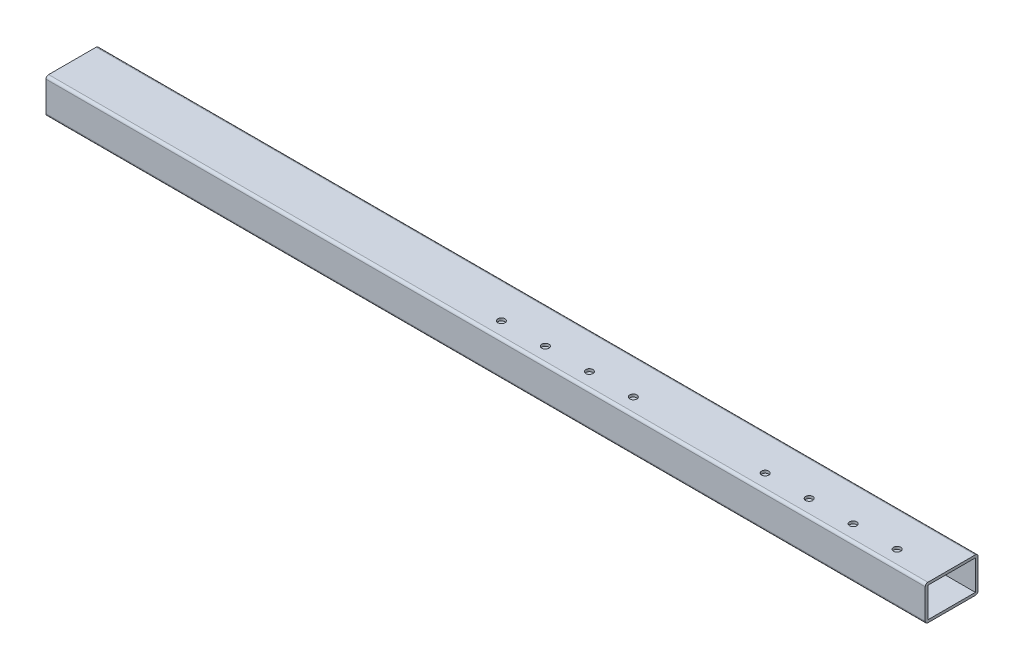
ISO-10303-21;
HEADER;
FILE_DESCRIPTION(('STEP AP214'),'2;1');
FILE_NAME('part.step','',(''),(''),'','','');
FILE_SCHEMA(('AUTOMOTIVE_DESIGN { 1 0 10303 214 1 1 1 1 }'));
ENDSEC;
DATA;
#1=APPLICATION_CONTEXT('core data for automotive mechanical design processes');
#2=APPLICATION_PROTOCOL_DEFINITION('international standard','automotive_design',2000,#1);
#3=PRODUCT_CONTEXT('',#1,'mechanical');
#4=PRODUCT('Part','Part','',(#3));
#5=PRODUCT_RELATED_PRODUCT_CATEGORY('part','',(#4));
#6=PRODUCT_DEFINITION_FORMATION('','',#4);
#7=PRODUCT_DEFINITION_CONTEXT('part definition',#1,'design');
#8=PRODUCT_DEFINITION('design','',#6,#7);
#9=PRODUCT_DEFINITION_SHAPE('','',#8);
#10=(LENGTH_UNIT() NAMED_UNIT(*) SI_UNIT(.MILLI.,.METRE.));
#11=(NAMED_UNIT(*) PLANE_ANGLE_UNIT() SI_UNIT($,.RADIAN.));
#12=(NAMED_UNIT(*) SI_UNIT($,.STERADIAN.) SOLID_ANGLE_UNIT());
#13=UNCERTAINTY_MEASURE_WITH_UNIT(LENGTH_MEASURE(1.E-05),#10,'distance_accuracy_value','');
#14=(GEOMETRIC_REPRESENTATION_CONTEXT(3) GLOBAL_UNCERTAINTY_ASSIGNED_CONTEXT((#13)) GLOBAL_UNIT_ASSIGNED_CONTEXT((#10,
#11,#12)) REPRESENTATION_CONTEXT('',''));
#15=CARTESIAN_POINT('',(0.,0.,0.));
#16=DIRECTION('',(0.,0.,1.));
#17=DIRECTION('',(1.,0.,0.));
#18=AXIS2_PLACEMENT_3D('',#15,#16,#17);
#19=CARTESIAN_POINT('',(1000.,17.,27.));
#20=DIRECTION('',(1.,0.,0.));
#21=DIRECTION('',(0.,0.,-1.));
#22=AXIS2_PLACEMENT_3D('',#19,#20,#21);
#23=PLANE('',#22);
#24=CARTESIAN_POINT('',(1000.,17.,27.));
#25=DIRECTION('',(1.,0.,0.));
#26=DIRECTION('',(0.,0.,-1.));
#27=AXIS2_PLACEMENT_3D('',#24,#25,#26);
#28=CIRCLE('',#27,2.99999999999999);
#29=CARTESIAN_POINT('',(1000.,20.,27.));
#30=VERTEX_POINT('',#29);
#31=CARTESIAN_POINT('',(1000.,17.,30.));
#32=VERTEX_POINT('',#31);
#33=EDGE_CURVE('E200',#30,#32,#28,.T.);
#34=ORIENTED_EDGE('',*,*,#33,.T.);
#35=DIRECTION('',(0.,-1.,0.));
#36=VECTOR('',#35,1.);
#37=CARTESIAN_POINT('',(1000.,17.,30.));
#38=LINE('',#37,#36);
#39=CARTESIAN_POINT('',(1000.,-17.,30.));
#40=VERTEX_POINT('',#39);
#41=EDGE_CURVE('E203',#32,#40,#38,.T.);
#42=ORIENTED_EDGE('',*,*,#41,.T.);
#43=CARTESIAN_POINT('',(1000.,-17.,27.));
#44=DIRECTION('',(1.,0.,0.));
#45=DIRECTION('',(0.,0.,-1.));
#46=AXIS2_PLACEMENT_3D('',#43,#44,#45);
#47=CIRCLE('',#46,3.);
#48=CARTESIAN_POINT('',(1000.,-20.,27.));
#49=VERTEX_POINT('',#48);
#50=EDGE_CURVE('E206',#40,#49,#47,.T.);
#51=ORIENTED_EDGE('',*,*,#50,.T.);
#52=DIRECTION('',(0.,0.,-1.));
#53=VECTOR('',#52,1.);
#54=CARTESIAN_POINT('',(1000.,-20.,27.));
#55=LINE('',#54,#53);
#56=CARTESIAN_POINT('',(1000.,-20.,-27.));
#57=VERTEX_POINT('',#56);
#58=EDGE_CURVE('E208',#49,#57,#55,.T.);
#59=ORIENTED_EDGE('',*,*,#58,.T.);
#60=CARTESIAN_POINT('',(1000.,-17.,-27.));
#61=DIRECTION('',(1.,0.,0.));
#62=DIRECTION('',(0.,0.,-1.));
#63=AXIS2_PLACEMENT_3D('',#60,#61,#62);
#64=CIRCLE('',#63,3.);
#65=CARTESIAN_POINT('',(1000.,-17.,-30.));
#66=VERTEX_POINT('',#65);
#67=EDGE_CURVE('E210',#57,#66,#64,.T.);
#68=ORIENTED_EDGE('',*,*,#67,.T.);
#69=DIRECTION('',(0.,1.,0.));
#70=VECTOR('',#69,1.);
#71=CARTESIAN_POINT('',(1000.,17.,-30.));
#72=LINE('',#71,#70);
#73=CARTESIAN_POINT('',(1000.,17.,-30.));
#74=VERTEX_POINT('',#73);
#75=EDGE_CURVE('E212',#66,#74,#72,.T.);
#76=ORIENTED_EDGE('',*,*,#75,.T.);
#77=CARTESIAN_POINT('',(1000.,17.,-27.));
#78=DIRECTION('',(1.,0.,0.));
#79=DIRECTION('',(0.,0.,1.));
#80=AXIS2_PLACEMENT_3D('',#77,#78,#79);
#81=CIRCLE('',#80,3.);
#82=CARTESIAN_POINT('',(1000.,20.,-27.));
#83=VERTEX_POINT('',#82);
#84=EDGE_CURVE('E214',#74,#83,#81,.T.);
#85=ORIENTED_EDGE('',*,*,#84,.T.);
#86=DIRECTION('',(0.,0.,1.));
#87=VECTOR('',#86,1.);
#88=CARTESIAN_POINT('',(1000.,20.,27.));
#89=LINE('',#88,#87);
#90=EDGE_CURVE('E216',#83,#30,#89,.T.);
#91=ORIENTED_EDGE('',*,*,#90,.T.);
#92=EDGE_LOOP('',(#34,#42,#51,#59,#68,#76,#85,#91));
#93=FACE_BOUND('',#92,.T.);
#94=DIRECTION('',(0.,0.,-1.));
#95=VECTOR('',#94,1.);
#96=CARTESIAN_POINT('',(1000.,-17.,27.));
#97=LINE('',#96,#95);
#98=CARTESIAN_POINT('',(1000.,-17.,27.));
#99=VERTEX_POINT('',#98);
#100=CARTESIAN_POINT('',(1000.,-17.,-27.));
#101=VERTEX_POINT('',#100);
#102=EDGE_CURVE('E170',#99,#101,#97,.T.);
#103=ORIENTED_EDGE('',*,*,#102,.F.);
#104=DIRECTION('',(0.,-1.,0.));
#105=VECTOR('',#104,1.);
#106=CARTESIAN_POINT('',(1000.,17.,27.));
#107=LINE('',#106,#105);
#108=CARTESIAN_POINT('',(1000.,17.,27.));
#109=VERTEX_POINT('',#108);
#110=EDGE_CURVE('E162',#109,#99,#107,.T.);
#111=ORIENTED_EDGE('',*,*,#110,.F.);
#112=DIRECTION('',(0.,0.,1.));
#113=VECTOR('',#112,1.);
#114=CARTESIAN_POINT('',(1000.,17.,27.));
#115=LINE('',#114,#113);
#116=CARTESIAN_POINT('',(1000.,17.,-27.));
#117=VERTEX_POINT('',#116);
#118=EDGE_CURVE('E184',#117,#109,#115,.T.);
#119=ORIENTED_EDGE('',*,*,#118,.F.);
#120=DIRECTION('',(0.,1.,0.));
#121=VECTOR('',#120,1.);
#122=CARTESIAN_POINT('',(1000.,17.,-27.));
#123=LINE('',#122,#121);
#124=EDGE_CURVE('E182',#101,#117,#123,.T.);
#125=ORIENTED_EDGE('',*,*,#124,.F.);
#126=EDGE_LOOP('',(#103,#111,#119,#125));
#127=FACE_BOUND('',#126,.T.);
#128=ADVANCED_FACE('F71',(#93,#127),#23,.T.);
#129=CARTESIAN_POINT('',(0.,17.,27.));
#130=DIRECTION('',(1.,0.,0.));
#131=DIRECTION('',(0.,0.,-1.));
#132=AXIS2_PLACEMENT_3D('',#129,#130,#131);
#133=PLANE('',#132);
#134=CARTESIAN_POINT('',(0.,17.,27.));
#135=DIRECTION('',(1.,0.,0.));
#136=DIRECTION('',(0.,0.,-1.));
#137=AXIS2_PLACEMENT_3D('',#134,#135,#136);
#138=CIRCLE('',#137,2.99999999999999);
#139=CARTESIAN_POINT('',(0.,20.,27.));
#140=VERTEX_POINT('',#139);
#141=CARTESIAN_POINT('',(0.,17.,30.));
#142=VERTEX_POINT('',#141);
#143=EDGE_CURVE('E178',#140,#142,#138,.T.);
#144=ORIENTED_EDGE('',*,*,#143,.F.);
#145=DIRECTION('',(0.,0.,1.));
#146=VECTOR('',#145,1.);
#147=CARTESIAN_POINT('',(0.,20.,27.));
#148=LINE('',#147,#146);
#149=CARTESIAN_POINT('',(0.,20.,-27.));
#150=VERTEX_POINT('',#149);
#151=EDGE_CURVE('E204',#150,#140,#148,.T.);
#152=ORIENTED_EDGE('',*,*,#151,.F.);
#153=CARTESIAN_POINT('',(0.,17.,-27.));
#154=DIRECTION('',(1.,0.,0.));
#155=DIRECTION('',(0.,0.,1.));
#156=AXIS2_PLACEMENT_3D('',#153,#154,#155);
#157=CIRCLE('',#156,3.);
#158=CARTESIAN_POINT('',(0.,17.,-30.));
#159=VERTEX_POINT('',#158);
#160=EDGE_CURVE('E231',#159,#150,#157,.T.);
#161=ORIENTED_EDGE('',*,*,#160,.F.);
#162=DIRECTION('',(0.,1.,0.));
#163=VECTOR('',#162,1.);
#164=CARTESIAN_POINT('',(0.,17.,-30.));
#165=LINE('',#164,#163);
#166=CARTESIAN_POINT('',(0.,-17.,-30.));
#167=VERTEX_POINT('',#166);
#168=EDGE_CURVE('E229',#167,#159,#165,.T.);
#169=ORIENTED_EDGE('',*,*,#168,.F.);
#170=CARTESIAN_POINT('',(0.,-17.,-27.));
#171=DIRECTION('',(1.,0.,0.));
#172=DIRECTION('',(0.,0.,-1.));
#173=AXIS2_PLACEMENT_3D('',#170,#171,#172);
#174=CIRCLE('',#173,3.);
#175=CARTESIAN_POINT('',(0.,-20.,-27.));
#176=VERTEX_POINT('',#175);
#177=EDGE_CURVE('E227',#176,#167,#174,.T.);
#178=ORIENTED_EDGE('',*,*,#177,.F.);
#179=DIRECTION('',(0.,0.,-1.));
#180=VECTOR('',#179,1.);
#181=CARTESIAN_POINT('',(0.,-20.,27.));
#182=LINE('',#181,#180);
#183=CARTESIAN_POINT('',(0.,-20.,27.));
#184=VERTEX_POINT('',#183);
#185=EDGE_CURVE('E225',#184,#176,#182,.T.);
#186=ORIENTED_EDGE('',*,*,#185,.F.);
#187=CARTESIAN_POINT('',(0.,-17.,27.));
#188=DIRECTION('',(1.,0.,0.));
#189=DIRECTION('',(0.,0.,-1.));
#190=AXIS2_PLACEMENT_3D('',#187,#188,#189);
#191=CIRCLE('',#190,3.);
#192=CARTESIAN_POINT('',(0.,-17.,30.));
#193=VERTEX_POINT('',#192);
#194=EDGE_CURVE('E223',#193,#184,#191,.T.);
#195=ORIENTED_EDGE('',*,*,#194,.F.);
#196=DIRECTION('',(0.,-1.,0.));
#197=VECTOR('',#196,1.);
#198=CARTESIAN_POINT('',(0.,17.,30.));
#199=LINE('',#198,#197);
#200=EDGE_CURVE('E221',#142,#193,#199,.T.);
#201=ORIENTED_EDGE('',*,*,#200,.F.);
#202=EDGE_LOOP('',(#144,#152,#161,#169,#178,#186,#195,#201));
#203=FACE_BOUND('',#202,.T.);
#204=DIRECTION('',(0.,-1.,0.));
#205=VECTOR('',#204,1.);
#206=CARTESIAN_POINT('',(0.,17.,27.));
#207=LINE('',#206,#205);
#208=CARTESIAN_POINT('',(0.,17.,27.));
#209=VERTEX_POINT('',#208);
#210=CARTESIAN_POINT('',(0.,-17.,27.));
#211=VERTEX_POINT('',#210);
#212=EDGE_CURVE('E96',#209,#211,#207,.T.);
#213=ORIENTED_EDGE('',*,*,#212,.T.);
#214=DIRECTION('',(0.,0.,-1.));
#215=VECTOR('',#214,1.);
#216=CARTESIAN_POINT('',(0.,-17.,27.));
#217=LINE('',#216,#215);
#218=CARTESIAN_POINT('',(0.,-17.,-27.));
#219=VERTEX_POINT('',#218);
#220=EDGE_CURVE('E177',#211,#219,#217,.T.);
#221=ORIENTED_EDGE('',*,*,#220,.T.);
#222=DIRECTION('',(0.,1.,0.));
#223=VECTOR('',#222,1.);
#224=CARTESIAN_POINT('',(0.,17.,-27.));
#225=LINE('',#224,#223);
#226=CARTESIAN_POINT('',(0.,17.,-27.));
#227=VERTEX_POINT('',#226);
#228=EDGE_CURVE('E192',#219,#227,#225,.T.);
#229=ORIENTED_EDGE('',*,*,#228,.T.);
#230=DIRECTION('',(0.,0.,1.));
#231=VECTOR('',#230,1.);
#232=CARTESIAN_POINT('',(0.,17.,27.));
#233=LINE('',#232,#231);
#234=EDGE_CURVE('E171',#227,#209,#233,.T.);
#235=ORIENTED_EDGE('',*,*,#234,.T.);
#236=EDGE_LOOP('',(#213,#221,#229,#235));
#237=FACE_BOUND('',#236,.T.);
#238=ADVANCED_FACE('F322',(#203,#237),#133,.F.);
#239=CARTESIAN_POINT('',(1000.,17.,27.));
#240=DIRECTION('',(-1.,0.,0.));
#241=DIRECTION('',(0.,0.,1.));
#242=AXIS2_PLACEMENT_3D('',#239,#240,#241);
#243=CYLINDRICAL_SURFACE('',#242,2.99999999999999);
#244=ORIENTED_EDGE('',*,*,#143,.T.);
#245=DIRECTION('',(-1.,0.,0.));
#246=VECTOR('',#245,1.);
#247=CARTESIAN_POINT('',(1000.,17.,30.));
#248=LINE('',#247,#246);
#249=EDGE_CURVE('E12',#32,#142,#248,.T.);
#250=ORIENTED_EDGE('',*,*,#249,.F.);
#251=ORIENTED_EDGE('',*,*,#33,.F.);
#252=DIRECTION('',(-1.,0.,0.));
#253=VECTOR('',#252,1.);
#254=CARTESIAN_POINT('',(1000.,20.,27.));
#255=LINE('',#254,#253);
#256=EDGE_CURVE('E218',#30,#140,#255,.T.);
#257=ORIENTED_EDGE('',*,*,#256,.T.);
#258=EDGE_LOOP('',(#244,#250,#251,#257));
#259=FACE_BOUND('',#258,.T.);
#260=ADVANCED_FACE('F73',(#259),#243,.T.);
#261=CARTESIAN_POINT('',(1000.,17.,30.));
#262=DIRECTION('',(0.,0.,-1.));
#263=DIRECTION('',(0.,1.,0.));
#264=AXIS2_PLACEMENT_3D('',#261,#262,#263);
#265=PLANE('',#264);
#266=ORIENTED_EDGE('',*,*,#200,.T.);
#267=DIRECTION('',(-1.,0.,0.));
#268=VECTOR('',#267,1.);
#269=CARTESIAN_POINT('',(1000.,-17.,30.));
#270=LINE('',#269,#268);
#271=EDGE_CURVE('E80',#40,#193,#270,.T.);
#272=ORIENTED_EDGE('',*,*,#271,.F.);
#273=ORIENTED_EDGE('',*,*,#41,.F.);
#274=ORIENTED_EDGE('',*,*,#249,.T.);
#275=EDGE_LOOP('',(#266,#272,#273,#274));
#276=FACE_BOUND('',#275,.T.);
#277=ADVANCED_FACE('F351',(#276),#265,.F.);
#278=CARTESIAN_POINT('',(1000.,-17.,27.));
#279=DIRECTION('',(-1.,0.,0.));
#280=DIRECTION('',(0.,0.,1.));
#281=AXIS2_PLACEMENT_3D('',#278,#279,#280);
#282=CYLINDRICAL_SURFACE('',#281,3.);
#283=ORIENTED_EDGE('',*,*,#194,.T.);
#284=DIRECTION('',(-1.,0.,0.));
#285=VECTOR('',#284,1.);
#286=CARTESIAN_POINT('',(1000.,-20.,27.));
#287=LINE('',#286,#285);
#288=EDGE_CURVE('E248',#49,#184,#287,.T.);
#289=ORIENTED_EDGE('',*,*,#288,.F.);
#290=ORIENTED_EDGE('',*,*,#50,.F.);
#291=ORIENTED_EDGE('',*,*,#271,.T.);
#292=EDGE_LOOP('',(#283,#289,#290,#291));
#293=FACE_BOUND('',#292,.T.);
#294=ADVANCED_FACE('F348',(#293),#282,.T.);
#295=CARTESIAN_POINT('',(1000.,-20.,27.));
#296=DIRECTION('',(0.,1.,0.));
#297=DIRECTION('',(0.,0.,1.));
#298=AXIS2_PLACEMENT_3D('',#295,#296,#297);
#299=PLANE('',#298);
#300=CARTESIAN_POINT('',(900.,-20.,12.0000000000003));
#301=DIRECTION('',(0.,1.,0.));
#302=DIRECTION('',(0.,0.,1.));
#303=AXIS2_PLACEMENT_3D('',#300,#301,#302);
#304=CIRCLE('',#303,4.05000000000013);
#305=CARTESIAN_POINT('',(900.,-20.,16.0500000000005));
#306=VERTEX_POINT('',#305);
#307=EDGE_CURVE('E261',#306,#306,#304,.T.);
#308=ORIENTED_EDGE('',*,*,#307,.T.);
#309=EDGE_LOOP('',(#308));
#310=FACE_BOUND('',#309,.T.);
#311=CARTESIAN_POINT('',(850.,-20.,12.0000000000007));
#312=DIRECTION('',(0.,1.,0.));
#313=DIRECTION('',(0.,0.,1.));
#314=AXIS2_PLACEMENT_3D('',#311,#312,#313);
#315=CIRCLE('',#314,4.05000000000013);
#316=CARTESIAN_POINT('',(850.,-20.,16.0500000000008));
#317=VERTEX_POINT('',#316);
#318=EDGE_CURVE('E448',#317,#317,#315,.T.);
#319=ORIENTED_EDGE('',*,*,#318,.T.);
#320=EDGE_LOOP('',(#319));
#321=FACE_BOUND('',#320,.T.);
#322=CARTESIAN_POINT('',(800.,-20.,12.000000000001));
#323=DIRECTION('',(0.,1.,0.));
#324=DIRECTION('',(0.,0.,1.));
#325=AXIS2_PLACEMENT_3D('',#322,#323,#324);
#326=CIRCLE('',#325,4.05000000000013);
#327=CARTESIAN_POINT('',(800.,-20.,16.0500000000012));
#328=VERTEX_POINT('',#327);
#329=EDGE_CURVE('E456',#328,#328,#326,.T.);
#330=ORIENTED_EDGE('',*,*,#329,.T.);
#331=EDGE_LOOP('',(#330));
#332=FACE_BOUND('',#331,.T.);
#333=CARTESIAN_POINT('',(650.,-20.,12.0000000000021));
#334=DIRECTION('',(0.,1.,0.));
#335=DIRECTION('',(0.,0.,1.));
#336=AXIS2_PLACEMENT_3D('',#333,#334,#335);
#337=CIRCLE('',#336,4.05000000000013);
#338=CARTESIAN_POINT('',(650.,-20.,16.0500000000022));
#339=VERTEX_POINT('',#338);
#340=EDGE_CURVE('E462',#339,#339,#337,.T.);
#341=ORIENTED_EDGE('',*,*,#340,.T.);
#342=EDGE_LOOP('',(#341));
#343=FACE_BOUND('',#342,.T.);
#344=CARTESIAN_POINT('',(600.,-20.,12.0000000000024));
#345=DIRECTION('',(0.,1.,0.));
#346=DIRECTION('',(0.,0.,1.));
#347=AXIS2_PLACEMENT_3D('',#344,#345,#346);
#348=CIRCLE('',#347,4.05000000000013);
#349=CARTESIAN_POINT('',(600.,-20.,16.0500000000026));
#350=VERTEX_POINT('',#349);
#351=EDGE_CURVE('E468',#350,#350,#348,.T.);
#352=ORIENTED_EDGE('',*,*,#351,.T.);
#353=EDGE_LOOP('',(#352));
#354=FACE_BOUND('',#353,.T.);
#355=CARTESIAN_POINT('',(550.,-20.,12.0000000000028));
#356=DIRECTION('',(0.,1.,0.));
#357=DIRECTION('',(0.,0.,1.));
#358=AXIS2_PLACEMENT_3D('',#355,#356,#357);
#359=CIRCLE('',#358,4.05000000000013);
#360=CARTESIAN_POINT('',(550.,-20.,16.0500000000029));
#361=VERTEX_POINT('',#360);
#362=EDGE_CURVE('E474',#361,#361,#359,.T.);
#363=ORIENTED_EDGE('',*,*,#362,.T.);
#364=EDGE_LOOP('',(#363));
#365=FACE_BOUND('',#364,.T.);
#366=CARTESIAN_POINT('',(500.,-20.,12.0000000000031));
#367=DIRECTION('',(0.,1.,0.));
#368=DIRECTION('',(0.,0.,1.));
#369=AXIS2_PLACEMENT_3D('',#366,#367,#368);
#370=CIRCLE('',#369,4.05000000000013);
#371=CARTESIAN_POINT('',(500.,-20.,16.0500000000033));
#372=VERTEX_POINT('',#371);
#373=EDGE_CURVE('E480',#372,#372,#370,.T.);
#374=ORIENTED_EDGE('',*,*,#373,.T.);
#375=EDGE_LOOP('',(#374));
#376=FACE_BOUND('',#375,.T.);
#377=CARTESIAN_POINT('',(950.,-20.,12.));
#378=DIRECTION('',(0.,1.,0.));
#379=DIRECTION('',(0.,0.,1.));
#380=AXIS2_PLACEMENT_3D('',#377,#378,#379);
#381=CIRCLE('',#380,4.05000000000013);
#382=CARTESIAN_POINT('',(950.,-20.,16.0500000000001));
#383=VERTEX_POINT('',#382);
#384=EDGE_CURVE('E256',#383,#383,#381,.T.);
#385=ORIENTED_EDGE('',*,*,#384,.T.);
#386=EDGE_LOOP('',(#385));
#387=FACE_BOUND('',#386,.T.);
#388=ORIENTED_EDGE('',*,*,#185,.T.);
#389=DIRECTION('',(-1.,0.,0.));
#390=VECTOR('',#389,1.);
#391=CARTESIAN_POINT('',(1000.,-20.,-27.));
#392=LINE('',#391,#390);
#393=EDGE_CURVE('E245',#57,#176,#392,.T.);
#394=ORIENTED_EDGE('',*,*,#393,.F.);
#395=ORIENTED_EDGE('',*,*,#58,.F.);
#396=ORIENTED_EDGE('',*,*,#288,.T.);
#397=EDGE_LOOP('',(#388,#394,#395,#396));
#398=FACE_BOUND('',#397,.T.);
#399=ADVANCED_FACE('F344',(#310,#321,#332,#343,#354,#365,#376,#387,#398),#299,.F.);
#400=CARTESIAN_POINT('',(1000.,-17.,-27.));
#401=DIRECTION('',(-1.,0.,0.));
#402=DIRECTION('',(0.,0.,1.));
#403=AXIS2_PLACEMENT_3D('',#400,#401,#402);
#404=CYLINDRICAL_SURFACE('',#403,3.);
#405=ORIENTED_EDGE('',*,*,#177,.T.);
#406=DIRECTION('',(-1.,0.,0.));
#407=VECTOR('',#406,1.);
#408=CARTESIAN_POINT('',(1000.,-17.,-30.));
#409=LINE('',#408,#407);
#410=EDGE_CURVE('E242',#66,#167,#409,.T.);
#411=ORIENTED_EDGE('',*,*,#410,.F.);
#412=ORIENTED_EDGE('',*,*,#67,.F.);
#413=ORIENTED_EDGE('',*,*,#393,.T.);
#414=EDGE_LOOP('',(#405,#411,#412,#413));
#415=FACE_BOUND('',#414,.T.);
#416=ADVANCED_FACE('F340',(#415),#404,.T.);
#417=CARTESIAN_POINT('',(1000.,17.,-30.));
#418=DIRECTION('',(0.,0.,1.));
#419=DIRECTION('',(0.,-1.,0.));
#420=AXIS2_PLACEMENT_3D('',#417,#418,#419);
#421=PLANE('',#420);
#422=ORIENTED_EDGE('',*,*,#168,.T.);
#423=DIRECTION('',(-1.,0.,0.));
#424=VECTOR('',#423,1.);
#425=CARTESIAN_POINT('',(1000.,17.,-30.));
#426=LINE('',#425,#424);
#427=EDGE_CURVE('E239',#74,#159,#426,.T.);
#428=ORIENTED_EDGE('',*,*,#427,.F.);
#429=ORIENTED_EDGE('',*,*,#75,.F.);
#430=ORIENTED_EDGE('',*,*,#410,.T.);
#431=EDGE_LOOP('',(#422,#428,#429,#430));
#432=FACE_BOUND('',#431,.T.);
#433=ADVANCED_FACE('F336',(#432),#421,.F.);
#434=CARTESIAN_POINT('',(1000.,17.,-27.));
#435=DIRECTION('',(-1.,0.,0.));
#436=DIRECTION('',(0.,0.,1.));
#437=AXIS2_PLACEMENT_3D('',#434,#435,#436);
#438=CYLINDRICAL_SURFACE('',#437,3.);
#439=ORIENTED_EDGE('',*,*,#160,.T.);
#440=DIRECTION('',(-1.,0.,0.));
#441=VECTOR('',#440,1.);
#442=CARTESIAN_POINT('',(1000.,20.,-27.));
#443=LINE('',#442,#441);
#444=EDGE_CURVE('E236',#83,#150,#443,.T.);
#445=ORIENTED_EDGE('',*,*,#444,.F.);
#446=ORIENTED_EDGE('',*,*,#84,.F.);
#447=ORIENTED_EDGE('',*,*,#427,.T.);
#448=EDGE_LOOP('',(#439,#445,#446,#447));
#449=FACE_BOUND('',#448,.T.);
#450=ADVANCED_FACE('F332',(#449),#438,.T.);
#451=CARTESIAN_POINT('',(1000.,20.,27.));
#452=DIRECTION('',(0.,-1.,0.));
#453=DIRECTION('',(0.,0.,-1.));
#454=AXIS2_PLACEMENT_3D('',#451,#452,#453);
#455=PLANE('',#454);
#456=CARTESIAN_POINT('',(900.,20.,12.0000000000003));
#457=DIRECTION('',(0.,1.,0.));
#458=DIRECTION('',(0.,0.,1.));
#459=AXIS2_PLACEMENT_3D('',#456,#457,#458);
#460=CIRCLE('',#459,4.05000000000013);
#461=CARTESIAN_POINT('',(900.,20.,16.0500000000005));
#462=VERTEX_POINT('',#461);
#463=EDGE_CURVE('E445',#462,#462,#460,.T.);
#464=ORIENTED_EDGE('',*,*,#463,.F.);
#465=EDGE_LOOP('',(#464));
#466=FACE_BOUND('',#465,.T.);
#467=CARTESIAN_POINT('',(850.,20.,12.0000000000007));
#468=DIRECTION('',(0.,1.,0.));
#469=DIRECTION('',(0.,0.,1.));
#470=AXIS2_PLACEMENT_3D('',#467,#468,#469);
#471=CIRCLE('',#470,4.05000000000013);
#472=CARTESIAN_POINT('',(850.,20.,16.0500000000008));
#473=VERTEX_POINT('',#472);
#474=EDGE_CURVE('E453',#473,#473,#471,.T.);
#475=ORIENTED_EDGE('',*,*,#474,.F.);
#476=EDGE_LOOP('',(#475));
#477=FACE_BOUND('',#476,.T.);
#478=CARTESIAN_POINT('',(800.,20.,12.000000000001));
#479=DIRECTION('',(0.,1.,0.));
#480=DIRECTION('',(0.,0.,1.));
#481=AXIS2_PLACEMENT_3D('',#478,#479,#480);
#482=CIRCLE('',#481,4.05000000000013);
#483=CARTESIAN_POINT('',(800.,20.,16.0500000000012));
#484=VERTEX_POINT('',#483);
#485=EDGE_CURVE('E459',#484,#484,#482,.T.);
#486=ORIENTED_EDGE('',*,*,#485,.F.);
#487=EDGE_LOOP('',(#486));
#488=FACE_BOUND('',#487,.T.);
#489=CARTESIAN_POINT('',(650.,20.,12.0000000000021));
#490=DIRECTION('',(0.,1.,0.));
#491=DIRECTION('',(0.,0.,1.));
#492=AXIS2_PLACEMENT_3D('',#489,#490,#491);
#493=CIRCLE('',#492,4.05000000000013);
#494=CARTESIAN_POINT('',(650.,20.,16.0500000000022));
#495=VERTEX_POINT('',#494);
#496=EDGE_CURVE('E465',#495,#495,#493,.T.);
#497=ORIENTED_EDGE('',*,*,#496,.F.);
#498=EDGE_LOOP('',(#497));
#499=FACE_BOUND('',#498,.T.);
#500=CARTESIAN_POINT('',(600.,20.,12.0000000000024));
#501=DIRECTION('',(0.,1.,0.));
#502=DIRECTION('',(0.,0.,1.));
#503=AXIS2_PLACEMENT_3D('',#500,#501,#502);
#504=CIRCLE('',#503,4.05000000000013);
#505=CARTESIAN_POINT('',(600.,20.,16.0500000000026));
#506=VERTEX_POINT('',#505);
#507=EDGE_CURVE('E471',#506,#506,#504,.T.);
#508=ORIENTED_EDGE('',*,*,#507,.F.);
#509=EDGE_LOOP('',(#508));
#510=FACE_BOUND('',#509,.T.);
#511=CARTESIAN_POINT('',(550.,20.,12.0000000000028));
#512=DIRECTION('',(0.,1.,0.));
#513=DIRECTION('',(0.,0.,1.));
#514=AXIS2_PLACEMENT_3D('',#511,#512,#513);
#515=CIRCLE('',#514,4.05000000000013);
#516=CARTESIAN_POINT('',(550.,20.,16.0500000000029));
#517=VERTEX_POINT('',#516);
#518=EDGE_CURVE('E477',#517,#517,#515,.T.);
#519=ORIENTED_EDGE('',*,*,#518,.F.);
#520=EDGE_LOOP('',(#519));
#521=FACE_BOUND('',#520,.T.);
#522=CARTESIAN_POINT('',(500.,20.,12.0000000000031));
#523=DIRECTION('',(0.,1.,0.));
#524=DIRECTION('',(0.,0.,1.));
#525=AXIS2_PLACEMENT_3D('',#522,#523,#524);
#526=CIRCLE('',#525,4.05000000000013);
#527=CARTESIAN_POINT('',(500.,20.,16.0500000000033));
#528=VERTEX_POINT('',#527);
#529=EDGE_CURVE('E483',#528,#528,#526,.T.);
#530=ORIENTED_EDGE('',*,*,#529,.F.);
#531=EDGE_LOOP('',(#530));
#532=FACE_BOUND('',#531,.T.);
#533=CARTESIAN_POINT('',(950.,20.,12.));
#534=DIRECTION('',(0.,1.,0.));
#535=DIRECTION('',(0.,0.,1.));
#536=AXIS2_PLACEMENT_3D('',#533,#534,#535);
#537=CIRCLE('',#536,4.05000000000013);
#538=CARTESIAN_POINT('',(950.,20.,16.0500000000001));
#539=VERTEX_POINT('',#538);
#540=EDGE_CURVE('E294',#539,#539,#537,.T.);
#541=ORIENTED_EDGE('',*,*,#540,.F.);
#542=EDGE_LOOP('',(#541));
#543=FACE_BOUND('',#542,.T.);
#544=ORIENTED_EDGE('',*,*,#151,.T.);
#545=ORIENTED_EDGE('',*,*,#256,.F.);
#546=ORIENTED_EDGE('',*,*,#90,.F.);
#547=ORIENTED_EDGE('',*,*,#444,.T.);
#548=EDGE_LOOP('',(#544,#545,#546,#547));
#549=FACE_BOUND('',#548,.T.);
#550=ADVANCED_FACE('F317',(#466,#477,#488,#499,#510,#521,#532,#543,#549),#455,.F.);
#551=CARTESIAN_POINT('',(1000.,17.,27.));
#552=DIRECTION('',(0.,0.,-1.));
#553=DIRECTION('',(0.,1.,0.));
#554=AXIS2_PLACEMENT_3D('',#551,#552,#553);
#555=PLANE('',#554);
#556=ORIENTED_EDGE('',*,*,#212,.F.);
#557=DIRECTION('',(-1.,0.,0.));
#558=VECTOR('',#557,1.);
#559=CARTESIAN_POINT('',(1000.,17.,27.));
#560=LINE('',#559,#558);
#561=EDGE_CURVE('E166',#109,#209,#560,.T.);
#562=ORIENTED_EDGE('',*,*,#561,.F.);
#563=ORIENTED_EDGE('',*,*,#110,.T.);
#564=DIRECTION('',(-1.,0.,0.));
#565=VECTOR('',#564,1.);
#566=CARTESIAN_POINT('',(1000.,-17.,27.));
#567=LINE('',#566,#565);
#568=EDGE_CURVE('E165',#99,#211,#567,.T.);
#569=ORIENTED_EDGE('',*,*,#568,.T.);
#570=EDGE_LOOP('',(#556,#562,#563,#569));
#571=FACE_BOUND('',#570,.T.);
#572=ADVANCED_FACE('F164',(#571),#555,.T.);
#573=CARTESIAN_POINT('',(1000.,-17.,27.));
#574=DIRECTION('',(0.,1.,0.));
#575=DIRECTION('',(0.,0.,1.));
#576=AXIS2_PLACEMENT_3D('',#573,#574,#575);
#577=PLANE('',#576);
#578=CARTESIAN_POINT('',(900.,-17.,12.0000000000003));
#579=DIRECTION('',(0.,1.,0.));
#580=DIRECTION('',(0.,0.,1.));
#581=AXIS2_PLACEMENT_3D('',#578,#579,#580);
#582=CIRCLE('',#581,4.05000000000013);
#583=CARTESIAN_POINT('',(900.,-17.,16.0500000000005));
#584=VERTEX_POINT('',#583);
#585=EDGE_CURVE('E291',#584,#584,#582,.T.);
#586=ORIENTED_EDGE('',*,*,#585,.F.);
#587=EDGE_LOOP('',(#586));
#588=FACE_BOUND('',#587,.T.);
#589=CARTESIAN_POINT('',(850.,-17.,12.0000000000007));
#590=DIRECTION('',(0.,1.,0.));
#591=DIRECTION('',(0.,0.,1.));
#592=AXIS2_PLACEMENT_3D('',#589,#590,#591);
#593=CIRCLE('',#592,4.05000000000013);
#594=CARTESIAN_POINT('',(850.,-17.,16.0500000000008));
#595=VERTEX_POINT('',#594);
#596=EDGE_CURVE('E279',#595,#595,#593,.T.);
#597=ORIENTED_EDGE('',*,*,#596,.F.);
#598=EDGE_LOOP('',(#597));
#599=FACE_BOUND('',#598,.T.);
#600=CARTESIAN_POINT('',(800.,-17.,12.000000000001));
#601=DIRECTION('',(0.,1.,0.));
#602=DIRECTION('',(0.,0.,1.));
#603=AXIS2_PLACEMENT_3D('',#600,#601,#602);
#604=CIRCLE('',#603,4.05000000000013);
#605=CARTESIAN_POINT('',(800.,-17.,16.0500000000012));
#606=VERTEX_POINT('',#605);
#607=EDGE_CURVE('E276',#606,#606,#604,.T.);
#608=ORIENTED_EDGE('',*,*,#607,.F.);
#609=EDGE_LOOP('',(#608));
#610=FACE_BOUND('',#609,.T.);
#611=CARTESIAN_POINT('',(650.,-17.,12.0000000000021));
#612=DIRECTION('',(0.,1.,0.));
#613=DIRECTION('',(0.,0.,1.));
#614=AXIS2_PLACEMENT_3D('',#611,#612,#613);
#615=CIRCLE('',#614,4.05000000000013);
#616=CARTESIAN_POINT('',(650.,-17.,16.0500000000022));
#617=VERTEX_POINT('',#616);
#618=EDGE_CURVE('E273',#617,#617,#615,.T.);
#619=ORIENTED_EDGE('',*,*,#618,.F.);
#620=EDGE_LOOP('',(#619));
#621=FACE_BOUND('',#620,.T.);
#622=CARTESIAN_POINT('',(600.,-17.,12.0000000000024));
#623=DIRECTION('',(0.,1.,0.));
#624=DIRECTION('',(0.,0.,1.));
#625=AXIS2_PLACEMENT_3D('',#622,#623,#624);
#626=CIRCLE('',#625,4.05000000000013);
#627=CARTESIAN_POINT('',(600.,-17.,16.0500000000026));
#628=VERTEX_POINT('',#627);
#629=EDGE_CURVE('E269',#628,#628,#626,.T.);
#630=ORIENTED_EDGE('',*,*,#629,.F.);
#631=EDGE_LOOP('',(#630));
#632=FACE_BOUND('',#631,.T.);
#633=CARTESIAN_POINT('',(550.,-17.,12.0000000000028));
#634=DIRECTION('',(0.,1.,0.));
#635=DIRECTION('',(0.,0.,1.));
#636=AXIS2_PLACEMENT_3D('',#633,#634,#635);
#637=CIRCLE('',#636,4.05000000000013);
#638=CARTESIAN_POINT('',(550.,-17.,16.0500000000029));
#639=VERTEX_POINT('',#638);
#640=EDGE_CURVE('E265',#639,#639,#637,.T.);
#641=ORIENTED_EDGE('',*,*,#640,.F.);
#642=EDGE_LOOP('',(#641));
#643=FACE_BOUND('',#642,.T.);
#644=CARTESIAN_POINT('',(500.,-17.,12.0000000000031));
#645=DIRECTION('',(0.,1.,0.));
#646=DIRECTION('',(0.,0.,1.));
#647=AXIS2_PLACEMENT_3D('',#644,#645,#646);
#648=CIRCLE('',#647,4.05000000000013);
#649=CARTESIAN_POINT('',(500.,-17.,16.0500000000033));
#650=VERTEX_POINT('',#649);
#651=EDGE_CURVE('E260',#650,#650,#648,.T.);
#652=ORIENTED_EDGE('',*,*,#651,.F.);
#653=EDGE_LOOP('',(#652));
#654=FACE_BOUND('',#653,.T.);
#655=CARTESIAN_POINT('',(950.,-17.,12.));
#656=DIRECTION('',(0.,1.,0.));
#657=DIRECTION('',(0.,0.,1.));
#658=AXIS2_PLACEMENT_3D('',#655,#656,#657);
#659=CIRCLE('',#658,4.05000000000013);
#660=CARTESIAN_POINT('',(950.,-17.,16.0500000000001));
#661=VERTEX_POINT('',#660);
#662=EDGE_CURVE('E190',#661,#661,#659,.T.);
#663=ORIENTED_EDGE('',*,*,#662,.F.);
#664=EDGE_LOOP('',(#663));
#665=FACE_BOUND('',#664,.T.);
#666=ORIENTED_EDGE('',*,*,#220,.F.);
#667=ORIENTED_EDGE('',*,*,#568,.F.);
#668=ORIENTED_EDGE('',*,*,#102,.T.);
#669=DIRECTION('',(-1.,0.,0.));
#670=VECTOR('',#669,1.);
#671=CARTESIAN_POINT('',(1000.,-17.,-27.));
#672=LINE('',#671,#670);
#673=EDGE_CURVE('E179',#101,#219,#672,.T.);
#674=ORIENTED_EDGE('',*,*,#673,.T.);
#675=EDGE_LOOP('',(#666,#667,#668,#674));
#676=FACE_BOUND('',#675,.T.);
#677=ADVANCED_FACE('F174',(#588,#599,#610,#621,#632,#643,#654,#665,#676),#577,.T.);
#678=CARTESIAN_POINT('',(1000.,17.,-27.));
#679=DIRECTION('',(0.,0.,1.));
#680=DIRECTION('',(0.,-1.,0.));
#681=AXIS2_PLACEMENT_3D('',#678,#679,#680);
#682=PLANE('',#681);
#683=ORIENTED_EDGE('',*,*,#228,.F.);
#684=ORIENTED_EDGE('',*,*,#673,.F.);
#685=ORIENTED_EDGE('',*,*,#124,.T.);
#686=DIRECTION('',(-1.,0.,0.));
#687=VECTOR('',#686,1.);
#688=CARTESIAN_POINT('',(1000.,17.,-27.));
#689=LINE('',#688,#687);
#690=EDGE_CURVE('E88',#117,#227,#689,.T.);
#691=ORIENTED_EDGE('',*,*,#690,.T.);
#692=EDGE_LOOP('',(#683,#684,#685,#691));
#693=FACE_BOUND('',#692,.T.);
#694=ADVANCED_FACE('F305',(#693),#682,.T.);
#695=CARTESIAN_POINT('',(1000.,17.,27.));
#696=DIRECTION('',(0.,-1.,0.));
#697=DIRECTION('',(0.,0.,-1.));
#698=AXIS2_PLACEMENT_3D('',#695,#696,#697);
#699=PLANE('',#698);
#700=CARTESIAN_POINT('',(900.,17.,12.0000000000003));
#701=DIRECTION('',(0.,-1.,0.));
#702=DIRECTION('',(0.,0.,-1.));
#703=AXIS2_PLACEMENT_3D('',#700,#701,#702);
#704=CIRCLE('',#703,4.05000000000013);
#705=CARTESIAN_POINT('',(900.,17.,7.95000000000022));
#706=VERTEX_POINT('',#705);
#707=EDGE_CURVE('E75',#706,#706,#704,.T.);
#708=ORIENTED_EDGE('',*,*,#707,.F.);
#709=EDGE_LOOP('',(#708));
#710=FACE_BOUND('',#709,.T.);
#711=CARTESIAN_POINT('',(850.,17.,12.0000000000007));
#712=DIRECTION('',(0.,-1.,0.));
#713=DIRECTION('',(0.,0.,-1.));
#714=AXIS2_PLACEMENT_3D('',#711,#712,#713);
#715=CIRCLE('',#714,4.05000000000013);
#716=CARTESIAN_POINT('',(850.,17.,7.95000000000057));
#717=VERTEX_POINT('',#716);
#718=EDGE_CURVE('E277',#717,#717,#715,.T.);
#719=ORIENTED_EDGE('',*,*,#718,.F.);
#720=EDGE_LOOP('',(#719));
#721=FACE_BOUND('',#720,.T.);
#722=CARTESIAN_POINT('',(800.,17.,12.000000000001));
#723=DIRECTION('',(0.,-1.,0.));
#724=DIRECTION('',(0.,0.,-1.));
#725=AXIS2_PLACEMENT_3D('',#722,#723,#724);
#726=CIRCLE('',#725,4.05000000000013);
#727=CARTESIAN_POINT('',(800.,17.,7.95000000000092));
#728=VERTEX_POINT('',#727);
#729=EDGE_CURVE('E274',#728,#728,#726,.T.);
#730=ORIENTED_EDGE('',*,*,#729,.F.);
#731=EDGE_LOOP('',(#730));
#732=FACE_BOUND('',#731,.T.);
#733=CARTESIAN_POINT('',(650.,17.,12.0000000000021));
#734=DIRECTION('',(0.,-1.,0.));
#735=DIRECTION('',(0.,0.,-1.));
#736=AXIS2_PLACEMENT_3D('',#733,#734,#735);
#737=CIRCLE('',#736,4.05000000000013);
#738=CARTESIAN_POINT('',(650.,17.,7.95000000000197));
#739=VERTEX_POINT('',#738);
#740=EDGE_CURVE('E270',#739,#739,#737,.T.);
#741=ORIENTED_EDGE('',*,*,#740,.F.);
#742=EDGE_LOOP('',(#741));
#743=FACE_BOUND('',#742,.T.);
#744=CARTESIAN_POINT('',(600.,17.,12.0000000000024));
#745=DIRECTION('',(0.,-1.,0.));
#746=DIRECTION('',(0.,0.,-1.));
#747=AXIS2_PLACEMENT_3D('',#744,#745,#746);
#748=CIRCLE('',#747,4.05000000000013);
#749=CARTESIAN_POINT('',(600.,17.,7.95000000000231));
#750=VERTEX_POINT('',#749);
#751=EDGE_CURVE('E266',#750,#750,#748,.T.);
#752=ORIENTED_EDGE('',*,*,#751,.F.);
#753=EDGE_LOOP('',(#752));
#754=FACE_BOUND('',#753,.T.);
#755=CARTESIAN_POINT('',(550.,17.,12.0000000000028));
#756=DIRECTION('',(0.,-1.,0.));
#757=DIRECTION('',(0.,0.,-1.));
#758=AXIS2_PLACEMENT_3D('',#755,#756,#757);
#759=CIRCLE('',#758,4.05000000000013);
#760=CARTESIAN_POINT('',(550.,17.,7.95000000000266));
#761=VERTEX_POINT('',#760);
#762=EDGE_CURVE('E262',#761,#761,#759,.T.);
#763=ORIENTED_EDGE('',*,*,#762,.F.);
#764=EDGE_LOOP('',(#763));
#765=FACE_BOUND('',#764,.T.);
#766=CARTESIAN_POINT('',(500.,17.,12.0000000000031));
#767=DIRECTION('',(0.,-1.,0.));
#768=DIRECTION('',(0.,0.,-1.));
#769=AXIS2_PLACEMENT_3D('',#766,#767,#768);
#770=CIRCLE('',#769,4.05000000000013);
#771=CARTESIAN_POINT('',(500.,17.,7.95000000000301));
#772=VERTEX_POINT('',#771);
#773=EDGE_CURVE('E257',#772,#772,#770,.T.);
#774=ORIENTED_EDGE('',*,*,#773,.F.);
#775=EDGE_LOOP('',(#774));
#776=FACE_BOUND('',#775,.T.);
#777=CARTESIAN_POINT('',(950.,17.,12.));
#778=DIRECTION('',(0.,-1.,0.));
#779=DIRECTION('',(0.,0.,-1.));
#780=AXIS2_PLACEMENT_3D('',#777,#778,#779);
#781=CIRCLE('',#780,4.05000000000013);
#782=CARTESIAN_POINT('',(950.,17.,7.94999999999987));
#783=VERTEX_POINT('',#782);
#784=EDGE_CURVE('E253',#783,#783,#781,.T.);
#785=ORIENTED_EDGE('',*,*,#784,.F.);
#786=EDGE_LOOP('',(#785));
#787=FACE_BOUND('',#786,.T.);
#788=ORIENTED_EDGE('',*,*,#234,.F.);
#789=ORIENTED_EDGE('',*,*,#690,.F.);
#790=ORIENTED_EDGE('',*,*,#118,.T.);
#791=ORIENTED_EDGE('',*,*,#561,.T.);
#792=EDGE_LOOP('',(#788,#789,#790,#791));
#793=FACE_BOUND('',#792,.T.);
#794=ADVANCED_FACE('F313',(#710,#721,#732,#743,#754,#765,#776,#787,#793),#699,.T.);
#795=CARTESIAN_POINT('',(950.,-20.,12.));
#796=DIRECTION('',(0.,1.,0.));
#797=DIRECTION('',(0.,0.,1.));
#798=AXIS2_PLACEMENT_3D('',#795,#796,#797);
#799=CYLINDRICAL_SURFACE('',#798,4.05000000000013);
#800=ORIENTED_EDGE('',*,*,#784,.T.);
#801=EDGE_LOOP('',(#800));
#802=FACE_BOUND('',#801,.T.);
#803=ORIENTED_EDGE('',*,*,#540,.T.);
#804=EDGE_LOOP('',(#803));
#805=FACE_BOUND('',#804,.T.);
#806=ADVANCED_FACE('F385',(#802,#805),#799,.F.);
#807=ORIENTED_EDGE('',*,*,#662,.T.);
#808=EDGE_LOOP('',(#807));
#809=FACE_BOUND('',#808,.T.);
#810=ORIENTED_EDGE('',*,*,#384,.F.);
#811=EDGE_LOOP('',(#810));
#812=FACE_BOUND('',#811,.T.);
#813=ADVANCED_FACE('F301',(#809,#812),#799,.F.);
#814=CARTESIAN_POINT('',(500.,-20.,12.0000000000031));
#815=DIRECTION('',(0.,1.,0.));
#816=DIRECTION('',(0.,0.,1.));
#817=AXIS2_PLACEMENT_3D('',#814,#815,#816);
#818=CYLINDRICAL_SURFACE('',#817,4.05000000000013);
#819=ORIENTED_EDGE('',*,*,#773,.T.);
#820=EDGE_LOOP('',(#819));
#821=FACE_BOUND('',#820,.T.);
#822=ORIENTED_EDGE('',*,*,#529,.T.);
#823=EDGE_LOOP('',(#822));
#824=FACE_BOUND('',#823,.T.);
#825=ADVANCED_FACE('F397',(#821,#824),#818,.F.);
#826=CARTESIAN_POINT('',(550.,-20.,12.0000000000028));
#827=DIRECTION('',(0.,1.,0.));
#828=DIRECTION('',(0.,0.,1.));
#829=AXIS2_PLACEMENT_3D('',#826,#827,#828);
#830=CYLINDRICAL_SURFACE('',#829,4.05000000000013);
#831=ORIENTED_EDGE('',*,*,#762,.T.);
#832=EDGE_LOOP('',(#831));
#833=FACE_BOUND('',#832,.T.);
#834=ORIENTED_EDGE('',*,*,#518,.T.);
#835=EDGE_LOOP('',(#834));
#836=FACE_BOUND('',#835,.T.);
#837=ADVANCED_FACE('F400',(#833,#836),#830,.F.);
#838=CARTESIAN_POINT('',(600.,-20.,12.0000000000024));
#839=DIRECTION('',(0.,1.,0.));
#840=DIRECTION('',(0.,0.,1.));
#841=AXIS2_PLACEMENT_3D('',#838,#839,#840);
#842=CYLINDRICAL_SURFACE('',#841,4.05000000000013);
#843=ORIENTED_EDGE('',*,*,#751,.T.);
#844=EDGE_LOOP('',(#843));
#845=FACE_BOUND('',#844,.T.);
#846=ORIENTED_EDGE('',*,*,#507,.T.);
#847=EDGE_LOOP('',(#846));
#848=FACE_BOUND('',#847,.T.);
#849=ADVANCED_FACE('F405',(#845,#848),#842,.F.);
#850=CARTESIAN_POINT('',(650.,-20.,12.0000000000021));
#851=DIRECTION('',(0.,1.,0.));
#852=DIRECTION('',(0.,0.,1.));
#853=AXIS2_PLACEMENT_3D('',#850,#851,#852);
#854=CYLINDRICAL_SURFACE('',#853,4.05000000000013);
#855=ORIENTED_EDGE('',*,*,#740,.T.);
#856=EDGE_LOOP('',(#855));
#857=FACE_BOUND('',#856,.T.);
#858=ORIENTED_EDGE('',*,*,#496,.T.);
#859=EDGE_LOOP('',(#858));
#860=FACE_BOUND('',#859,.T.);
#861=ADVANCED_FACE('F410',(#857,#860),#854,.F.);
#862=CARTESIAN_POINT('',(800.,-20.,12.000000000001));
#863=DIRECTION('',(0.,1.,0.));
#864=DIRECTION('',(0.,0.,1.));
#865=AXIS2_PLACEMENT_3D('',#862,#863,#864);
#866=CYLINDRICAL_SURFACE('',#865,4.05000000000013);
#867=ORIENTED_EDGE('',*,*,#729,.T.);
#868=EDGE_LOOP('',(#867));
#869=FACE_BOUND('',#868,.T.);
#870=ORIENTED_EDGE('',*,*,#485,.T.);
#871=EDGE_LOOP('',(#870));
#872=FACE_BOUND('',#871,.T.);
#873=ADVANCED_FACE('F415',(#869,#872),#866,.F.);
#874=CARTESIAN_POINT('',(850.,-20.,12.0000000000007));
#875=DIRECTION('',(0.,1.,0.));
#876=DIRECTION('',(0.,0.,1.));
#877=AXIS2_PLACEMENT_3D('',#874,#875,#876);
#878=CYLINDRICAL_SURFACE('',#877,4.05000000000013);
#879=ORIENTED_EDGE('',*,*,#718,.T.);
#880=EDGE_LOOP('',(#879));
#881=FACE_BOUND('',#880,.T.);
#882=ORIENTED_EDGE('',*,*,#474,.T.);
#883=EDGE_LOOP('',(#882));
#884=FACE_BOUND('',#883,.T.);
#885=ADVANCED_FACE('F420',(#881,#884),#878,.F.);
#886=CARTESIAN_POINT('',(900.,-20.,12.0000000000003));
#887=DIRECTION('',(0.,1.,0.));
#888=DIRECTION('',(0.,0.,1.));
#889=AXIS2_PLACEMENT_3D('',#886,#887,#888);
#890=CYLINDRICAL_SURFACE('',#889,4.05000000000013);
#891=ORIENTED_EDGE('',*,*,#707,.T.);
#892=EDGE_LOOP('',(#891));
#893=FACE_BOUND('',#892,.T.);
#894=ORIENTED_EDGE('',*,*,#463,.T.);
#895=EDGE_LOOP('',(#894));
#896=FACE_BOUND('',#895,.T.);
#897=ADVANCED_FACE('F425',(#893,#896),#890,.F.);
#898=ORIENTED_EDGE('',*,*,#651,.T.);
#899=EDGE_LOOP('',(#898));
#900=FACE_BOUND('',#899,.T.);
#901=ORIENTED_EDGE('',*,*,#373,.F.);
#902=EDGE_LOOP('',(#901));
#903=FACE_BOUND('',#902,.T.);
#904=ADVANCED_FACE('F402',(#900,#903),#818,.F.);
#905=ORIENTED_EDGE('',*,*,#640,.T.);
#906=EDGE_LOOP('',(#905));
#907=FACE_BOUND('',#906,.T.);
#908=ORIENTED_EDGE('',*,*,#362,.F.);
#909=EDGE_LOOP('',(#908));
#910=FACE_BOUND('',#909,.T.);
#911=ADVANCED_FACE('F407',(#907,#910),#830,.F.);
#912=ORIENTED_EDGE('',*,*,#629,.T.);
#913=EDGE_LOOP('',(#912));
#914=FACE_BOUND('',#913,.T.);
#915=ORIENTED_EDGE('',*,*,#351,.F.);
#916=EDGE_LOOP('',(#915));
#917=FACE_BOUND('',#916,.T.);
#918=ADVANCED_FACE('F412',(#914,#917),#842,.F.);
#919=ORIENTED_EDGE('',*,*,#618,.T.);
#920=EDGE_LOOP('',(#919));
#921=FACE_BOUND('',#920,.T.);
#922=ORIENTED_EDGE('',*,*,#340,.F.);
#923=EDGE_LOOP('',(#922));
#924=FACE_BOUND('',#923,.T.);
#925=ADVANCED_FACE('F417',(#921,#924),#854,.F.);
#926=ORIENTED_EDGE('',*,*,#607,.T.);
#927=EDGE_LOOP('',(#926));
#928=FACE_BOUND('',#927,.T.);
#929=ORIENTED_EDGE('',*,*,#329,.F.);
#930=EDGE_LOOP('',(#929));
#931=FACE_BOUND('',#930,.T.);
#932=ADVANCED_FACE('F422',(#928,#931),#866,.F.);
#933=ORIENTED_EDGE('',*,*,#596,.T.);
#934=EDGE_LOOP('',(#933));
#935=FACE_BOUND('',#934,.T.);
#936=ORIENTED_EDGE('',*,*,#318,.F.);
#937=EDGE_LOOP('',(#936));
#938=FACE_BOUND('',#937,.T.);
#939=ADVANCED_FACE('F426',(#935,#938),#878,.F.);
#940=ORIENTED_EDGE('',*,*,#585,.T.);
#941=EDGE_LOOP('',(#940));
#942=FACE_BOUND('',#941,.T.);
#943=ORIENTED_EDGE('',*,*,#307,.F.);
#944=EDGE_LOOP('',(#943));
#945=FACE_BOUND('',#944,.T.);
#946=ADVANCED_FACE('F429',(#942,#945),#890,.F.);
#947=CLOSED_SHELL('',(#128,#238,#260,#277,#294,#399,#416,#433,#450,#550,#572,#677,#694,#794,
#806,#813,#825,#837,#849,#861,#873,#885,#897,#904,#911,#918,#925,#932,#939,#946));
#948=MANIFOLD_SOLID_BREP('B2',#947);
#949=ADVANCED_BREP_SHAPE_REPRESENTATION('',(#18,#948),#14);
#950=SHAPE_DEFINITION_REPRESENTATION(#9,#949);
ENDSEC;
END-ISO-10303-21;
